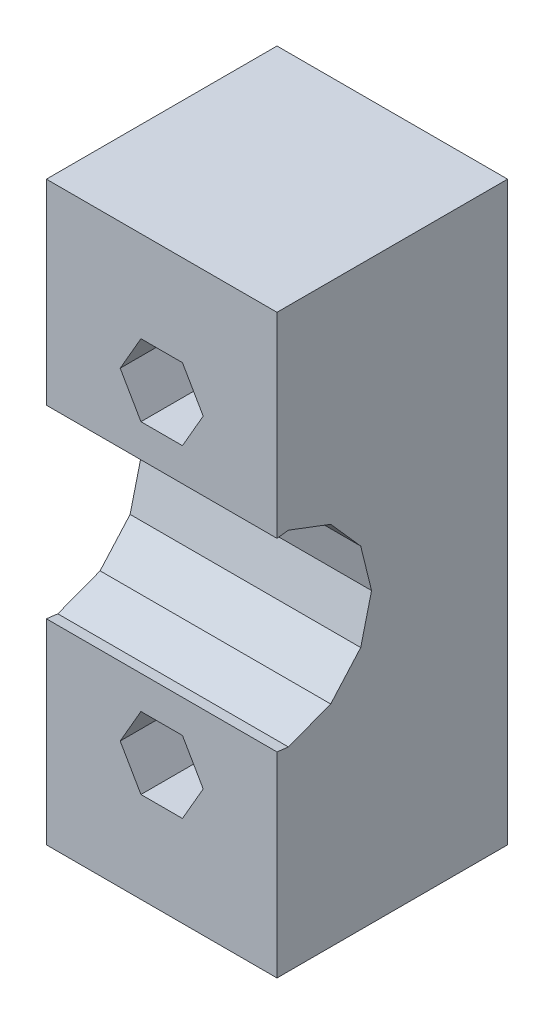
ISO-10303-21;
HEADER;
FILE_DESCRIPTION(('STEP AP214'),'2;1');
FILE_NAME('part.step','',(''),(''),'','','');
FILE_SCHEMA(('AUTOMOTIVE_DESIGN { 1 0 10303 214 1 1 1 1 }'));
ENDSEC;
DATA;
#1=APPLICATION_CONTEXT('core data for automotive mechanical design processes');
#2=APPLICATION_PROTOCOL_DEFINITION('international standard','automotive_design',2000,#1);
#3=PRODUCT_CONTEXT('',#1,'mechanical');
#4=PRODUCT('Part','Part','',(#3));
#5=PRODUCT_RELATED_PRODUCT_CATEGORY('part','',(#4));
#6=PRODUCT_DEFINITION_FORMATION('','',#4);
#7=PRODUCT_DEFINITION_CONTEXT('part definition',#1,'design');
#8=PRODUCT_DEFINITION('design','',#6,#7);
#9=PRODUCT_DEFINITION_SHAPE('','',#8);
#10=(LENGTH_UNIT() NAMED_UNIT(*) SI_UNIT(.MILLI.,.METRE.));
#11=(NAMED_UNIT(*) PLANE_ANGLE_UNIT() SI_UNIT($,.RADIAN.));
#12=(NAMED_UNIT(*) SI_UNIT($,.STERADIAN.) SOLID_ANGLE_UNIT());
#13=UNCERTAINTY_MEASURE_WITH_UNIT(LENGTH_MEASURE(1.E-05),#10,'distance_accuracy_value','');
#14=(GEOMETRIC_REPRESENTATION_CONTEXT(3) GLOBAL_UNCERTAINTY_ASSIGNED_CONTEXT((#13)) GLOBAL_UNIT_ASSIGNED_CONTEXT((#10,
#11,#12)) REPRESENTATION_CONTEXT('',''));
#15=CARTESIAN_POINT('',(0.,0.,0.));
#16=DIRECTION('',(0.,0.,1.));
#17=DIRECTION('',(1.,0.,0.));
#18=AXIS2_PLACEMENT_3D('',#15,#16,#17);
#19=CARTESIAN_POINT('',(0.121361373031,-4.054731070448,9.632423622737));
#20=DIRECTION('',(0.,0.99270878246258,-0.120537434938949));
#21=DIRECTION('',(0.,0.120537434938949,0.99270878246258));
#22=AXIS2_PLACEMENT_3D('',#19,#20,#21);
#23=PLANE('',#22);
#24=DIRECTION('',(1.,0.,0.));
#25=VECTOR('',#24,1.);
#26=CARTESIAN_POINT('',(-0.442914699107,-4.07010602950984,9.50580024719206));
#27=LINE('',#26,#25);
#28=CARTESIAN_POINT('',(-4.99999999999985,-4.07010602951022,9.50580024719204));
#29=VERTEX_POINT('',#28);
#30=CARTESIAN_POINT('',(5.,-4.07010602951012,9.50580024719204));
#31=VERTEX_POINT('',#30);
#32=EDGE_CURVE('E200',#29,#31,#27,.T.);
#33=ORIENTED_EDGE('',*,*,#32,.F.);
#34=DIRECTION('',(0.,-0.120537434938949,-0.99270878246258));
#35=VECTOR('',#34,1.);
#36=CARTESIAN_POINT('',(-5.,-4.025473893236,9.873376624455));
#37=LINE('',#36,#35);
#38=CARTESIAN_POINT('',(-4.99999999999999,-4.01009893417385,9.99999999999998));
#39=VERTEX_POINT('',#38);
#40=EDGE_CURVE('E19',#39,#29,#37,.T.);
#41=ORIENTED_EDGE('',*,*,#40,.F.);
#42=DIRECTION('',(-1.,0.,0.));
#43=VECTOR('',#42,1.);
#44=CARTESIAN_POINT('',(5.,-4.010098934174,10.));
#45=LINE('',#44,#43);
#46=CARTESIAN_POINT('',(5.00000000000001,-4.01009893417388,9.99999999999998));
#47=VERTEX_POINT('',#46);
#48=EDGE_CURVE('E210',#39,#47,#45,.F.);
#49=ORIENTED_EDGE('',*,*,#48,.T.);
#50=DIRECTION('',(0.,-0.120537434937309,-0.992708782462779));
#51=VECTOR('',#50,1.);
#52=CARTESIAN_POINT('',(5.,-4.010098934174,10.));
#53=LINE('',#52,#51);
#54=EDGE_CURVE('E192',#47,#31,#53,.T.);
#55=ORIENTED_EDGE('',*,*,#54,.T.);
#56=EDGE_LOOP('',(#33,#41,#49,#55));
#57=FACE_BOUND('',#56,.T.);
#58=ADVANCED_FACE('F16',(#57),#23,.T.);
#59=CARTESIAN_POINT('',(0.899999976158,5.441154003143,10.));
#60=DIRECTION('',(0.,-1.,0.));
#61=DIRECTION('',(0.,0.,-1.));
#62=AXIS2_PLACEMENT_3D('',#59,#60,#61);
#63=PLANE('',#62);
#64=DIRECTION('',(0.,0.,1.));
#65=VECTOR('',#64,1.);
#66=CARTESIAN_POINT('',(-0.899999976158,5.441154003143,10.));
#67=LINE('',#66,#65);
#68=CARTESIAN_POINT('',(-0.899999976162008,5.44115400314991,0.));
#69=VERTEX_POINT('',#68);
#70=CARTESIAN_POINT('',(-0.899999976155778,5.44115400313916,10.));
#71=VERTEX_POINT('',#70);
#72=EDGE_CURVE('E227',#69,#71,#67,.T.);
#73=ORIENTED_EDGE('',*,*,#72,.T.);
#74=DIRECTION('',(-1.,0.,0.));
#75=VECTOR('',#74,1.);
#76=CARTESIAN_POINT('',(-0.899999976158,5.441154003143,10.));
#77=LINE('',#76,#75);
#78=CARTESIAN_POINT('',(0.899999976158001,5.441154003143,10.));
#79=VERTEX_POINT('',#78);
#80=EDGE_CURVE('E236',#71,#79,#77,.F.);
#81=ORIENTED_EDGE('',*,*,#80,.T.);
#82=DIRECTION('',(0.,0.,1.));
#83=VECTOR('',#82,1.);
#84=CARTESIAN_POINT('',(0.899999976158008,5.44115400314299,10.));
#85=LINE('',#84,#83);
#86=CARTESIAN_POINT('',(0.899999976158011,5.44115400314299,0.));
#87=VERTEX_POINT('',#86);
#88=EDGE_CURVE('E224',#79,#87,#85,.F.);
#89=ORIENTED_EDGE('',*,*,#88,.T.);
#90=DIRECTION('',(1.,0.,0.));
#91=VECTOR('',#90,1.);
#92=CARTESIAN_POINT('',(0.899999976158,5.441154003143,0.));
#93=LINE('',#92,#91);
#94=EDGE_CURVE('E212',#69,#87,#93,.T.);
#95=ORIENTED_EDGE('',*,*,#94,.F.);
#96=EDGE_LOOP('',(#73,#81,#89,#95));
#97=FACE_BOUND('',#96,.T.);
#98=ADVANCED_FACE('F439',(#97),#63,.F.);
#99=CARTESIAN_POINT('',(1.145088556227,-8.134340386022,5.40982297143));
#100=DIRECTION('',(0.866025513253365,-0.49999981039421,0.));
#101=DIRECTION('',(0.49999981039421,0.866025513253365,0.));
#102=AXIS2_PLACEMENT_3D('',#99,#100,#101);
#103=PLANE('',#102);
#104=DIRECTION('',(0.,0.,-1.));
#105=VECTOR('',#104,1.);
#106=CARTESIAN_POINT('',(0.899999976158,-8.558846473694,0.));
#107=LINE('',#106,#105);
#108=CARTESIAN_POINT('',(0.89999997615768,-8.55884647369382,0.));
#109=VERTEX_POINT('',#108);
#110=CARTESIAN_POINT('',(0.89999997615796,-8.55884647369397,10.));
#111=VERTEX_POINT('',#110);
#112=EDGE_CURVE('E250',#109,#111,#107,.F.);
#113=ORIENTED_EDGE('',*,*,#112,.T.);
#114=DIRECTION('',(0.49999981039421,0.866025513253365,0.));
#115=VECTOR('',#114,1.);
#116=CARTESIAN_POINT('',(1.145088556227,-8.134340386022,10.));
#117=LINE('',#116,#115);
#118=CARTESIAN_POINT('',(1.79999995231601,-7.00000000000001,10.));
#119=VERTEX_POINT('',#118);
#120=EDGE_CURVE('E181',#119,#111,#117,.F.);
#121=ORIENTED_EDGE('',*,*,#120,.F.);
#122=DIRECTION('',(0.,0.,1.));
#123=VECTOR('',#122,1.);
#124=CARTESIAN_POINT('',(1.79999995231599,-7.00000000000001,10.));
#125=LINE('',#124,#123);
#126=CARTESIAN_POINT('',(1.79999995231593,-6.99999999999999,0.));
#127=VERTEX_POINT('',#126);
#128=EDGE_CURVE('E222',#119,#127,#125,.F.);
#129=ORIENTED_EDGE('',*,*,#128,.T.);
#130=DIRECTION('',(-0.499999810394001,-0.866025513253486,0.));
#131=VECTOR('',#130,1.);
#132=CARTESIAN_POINT('',(1.799999952316,-7.,0.));
#133=LINE('',#132,#131);
#134=EDGE_CURVE('E247',#127,#109,#133,.T.);
#135=ORIENTED_EDGE('',*,*,#134,.T.);
#136=EDGE_LOOP('',(#113,#121,#129,#135));
#137=FACE_BOUND('',#136,.T.);
#138=ADVANCED_FACE('F614',(#137),#103,.F.);
#139=CARTESIAN_POINT('',(1.554911376783,6.575494050037,4.590177113519));
#140=DIRECTION('',(-0.866025447026178,0.499999925103103,0.));
#141=DIRECTION('',(-0.499999925103103,-0.866025447026178,0.));
#142=AXIS2_PLACEMENT_3D('',#139,#140,#141);
#143=PLANE('',#142);
#144=DIRECTION('',(-0.499999925103108,-0.866025447026175,0.));
#145=VECTOR('',#144,1.);
#146=CARTESIAN_POINT('',(1.799999952316,7.,0.));
#147=LINE('',#146,#145);
#148=CARTESIAN_POINT('',(1.79999995231476,6.99999999999753,0.));
#149=VERTEX_POINT('',#148);
#150=EDGE_CURVE('E255',#149,#87,#147,.T.);
#151=ORIENTED_EDGE('',*,*,#150,.T.);
#152=ORIENTED_EDGE('',*,*,#88,.F.);
#153=DIRECTION('',(0.499999925103108,0.866025447026175,0.));
#154=VECTOR('',#153,1.);
#155=CARTESIAN_POINT('',(0.899999976158,5.441154003143,10.));
#156=LINE('',#155,#154);
#157=CARTESIAN_POINT('',(1.79999995231607,6.99999999999995,10.));
#158=VERTEX_POINT('',#157);
#159=EDGE_CURVE('E258',#79,#158,#156,.T.);
#160=ORIENTED_EDGE('',*,*,#159,.T.);
#161=DIRECTION('',(0.,0.,1.));
#162=VECTOR('',#161,1.);
#163=CARTESIAN_POINT('',(1.79999995231591,6.99999999999995,5.40982297143));
#164=LINE('',#163,#162);
#165=EDGE_CURVE('E261',#158,#149,#164,.F.);
#166=ORIENTED_EDGE('',*,*,#165,.T.);
#167=EDGE_LOOP('',(#151,#152,#160,#166));
#168=FACE_BOUND('',#167,.T.);
#169=ADVANCED_FACE('F454',(#168),#143,.T.);
#170=CARTESIAN_POINT('',(-1.554911376783,6.575494050037,4.590177113519));
#171=DIRECTION('',(0.866025447026178,0.499999925103103,0.));
#172=DIRECTION('',(-0.499999925103103,0.866025447026178,0.));
#173=AXIS2_PLACEMENT_3D('',#170,#171,#172);
#174=PLANE('',#173);
#175=DIRECTION('',(0.,0.,1.));
#176=VECTOR('',#175,1.);
#177=CARTESIAN_POINT('',(-1.79999995231591,6.99999999999995,5.40982297143));
#178=LINE('',#177,#176);
#179=CARTESIAN_POINT('',(-1.79999995231334,6.99999999999525,9.99999999999999));
#180=VERTEX_POINT('',#179);
#181=CARTESIAN_POINT('',(-1.7999999523354,7.00000000003331,0.));
#182=VERTEX_POINT('',#181);
#183=EDGE_CURVE('E267',#180,#182,#178,.F.);
#184=ORIENTED_EDGE('',*,*,#183,.F.);
#185=DIRECTION('',(0.499999925103107,-0.866025447026175,0.));
#186=VECTOR('',#185,1.);
#187=CARTESIAN_POINT('',(-1.799999952316,7.,10.));
#188=LINE('',#187,#186);
#189=EDGE_CURVE('E264',#180,#71,#188,.T.);
#190=ORIENTED_EDGE('',*,*,#189,.T.);
#191=ORIENTED_EDGE('',*,*,#72,.F.);
#192=DIRECTION('',(-0.499999925103103,0.866025447026178,0.));
#193=VECTOR('',#192,1.);
#194=CARTESIAN_POINT('',(-1.554911376783,6.575494050037,0.));
#195=LINE('',#194,#193);
#196=EDGE_CURVE('E207',#69,#182,#195,.T.);
#197=ORIENTED_EDGE('',*,*,#196,.T.);
#198=EDGE_LOOP('',(#184,#190,#191,#197));
#199=FACE_BOUND('',#198,.T.);
#200=ADVANCED_FACE('F444',(#199),#174,.T.);
#201=CARTESIAN_POINT('',(5.,-3.374233961105,7.670935153961));
#202=DIRECTION('',(0.,-0.935016322615487,-0.354604676284185));
#203=DIRECTION('',(0.,0.354604676284185,-0.935016322615487));
#204=AXIS2_PLACEMENT_3D('',#201,#202,#203);
#205=PLANE('',#204);
#206=DIRECTION('',(1.,0.,0.));
#207=VECTOR('',#206,1.);
#208=CARTESIAN_POINT('',(-0.442914888167,-3.37423396110522,7.67093515396075));
#209=LINE('',#208,#207);
#210=CARTESIAN_POINT('',(-5.,-3.37423396110519,7.67093515396092));
#211=VERTEX_POINT('',#210);
#212=CARTESIAN_POINT('',(5.,-3.37423396110503,7.67093515396097));
#213=VERTEX_POINT('',#212);
#214=EDGE_CURVE('E276',#211,#213,#209,.T.);
#215=ORIENTED_EDGE('',*,*,#214,.F.);
#216=DIRECTION('',(0.,-0.354604676284445,0.935016322615389));
#217=VECTOR('',#216,1.);
#218=CARTESIAN_POINT('',(-5.,-3.374233961105,7.670935153961));
#219=LINE('',#218,#217);
#220=EDGE_CURVE('E205',#211,#29,#219,.T.);
#221=ORIENTED_EDGE('',*,*,#220,.T.);
#222=ORIENTED_EDGE('',*,*,#32,.T.);
#223=DIRECTION('',(0.,0.354604676284185,-0.935016322615487));
#224=VECTOR('',#223,1.);
#225=CARTESIAN_POINT('',(5.,-3.374233961105,7.670935153961));
#226=LINE('',#225,#224);
#227=EDGE_CURVE('E186',#213,#31,#226,.F.);
#228=ORIENTED_EDGE('',*,*,#227,.F.);
#229=EDGE_LOOP('',(#215,#221,#222,#228));
#230=FACE_BOUND('',#229,.T.);
#231=ADVANCED_FACE('F204',(#230),#205,.F.);
#232=CARTESIAN_POINT('',(0.899999976158,-8.558846473694,10.));
#233=DIRECTION('',(0.,-1.,0.));
#234=DIRECTION('',(0.,0.,-1.));
#235=AXIS2_PLACEMENT_3D('',#232,#233,#234);
#236=PLANE('',#235);
#237=DIRECTION('',(0.,0.,1.));
#238=VECTOR('',#237,1.);
#239=CARTESIAN_POINT('',(-0.899999976157658,-8.5588464736938,5.40982297143));
#240=LINE('',#239,#238);
#241=CARTESIAN_POINT('',(-0.899999976157972,-8.55884647369398,0.));
#242=VERTEX_POINT('',#241);
#243=CARTESIAN_POINT('',(-0.89999997615799,-8.558846473694,10.));
#244=VERTEX_POINT('',#243);
#245=EDGE_CURVE('E290',#242,#244,#240,.T.);
#246=ORIENTED_EDGE('',*,*,#245,.T.);
#247=DIRECTION('',(1.,0.,0.));
#248=VECTOR('',#247,1.);
#249=CARTESIAN_POINT('',(0.899999976158,-8.558846473694,10.));
#250=LINE('',#249,#248);
#251=EDGE_CURVE('E252',#111,#244,#250,.F.);
#252=ORIENTED_EDGE('',*,*,#251,.F.);
#253=ORIENTED_EDGE('',*,*,#112,.F.);
#254=DIRECTION('',(1.,0.,0.));
#255=VECTOR('',#254,1.);
#256=CARTESIAN_POINT('',(-0.899999976158,-8.558846473694,0.));
#257=LINE('',#256,#255);
#258=EDGE_CURVE('E284',#109,#242,#257,.F.);
#259=ORIENTED_EDGE('',*,*,#258,.T.);
#260=EDGE_LOOP('',(#246,#252,#253,#259));
#261=FACE_BOUND('',#260,.T.);
#262=ADVANCED_FACE('F588',(#261),#236,.F.);
#263=CARTESIAN_POINT('',(-1.799999952316,-7.,10.));
#264=DIRECTION('',(0.,0.,-1.));
#265=DIRECTION('',(-1.,0.,0.));
#266=AXIS2_PLACEMENT_3D('',#263,#264,#265);
#267=PLANE('',#266);
#268=DIRECTION('',(0.,1.,0.));
#269=VECTOR('',#268,1.);
#270=CARTESIAN_POINT('',(5.,-4.010098934174,10.));
#271=LINE('',#270,#269);
#272=CARTESIAN_POINT('',(5.,-12.5,10.));
#273=VERTEX_POINT('',#272);
#274=EDGE_CURVE('E245',#273,#47,#271,.T.);
#275=ORIENTED_EDGE('',*,*,#274,.T.);
#276=ORIENTED_EDGE('',*,*,#48,.F.);
#277=DIRECTION('',(0.,1.,0.));
#278=VECTOR('',#277,1.);
#279=CARTESIAN_POINT('',(-5.,-4.010098934174,10.));
#280=LINE('',#279,#278);
#281=CARTESIAN_POINT('',(-5.,-12.5,10.));
#282=VERTEX_POINT('',#281);
#283=EDGE_CURVE('E214',#282,#39,#280,.T.);
#284=ORIENTED_EDGE('',*,*,#283,.F.);
#285=DIRECTION('',(1.,0.,0.));
#286=VECTOR('',#285,1.);
#287=CARTESIAN_POINT('',(5.,-12.5,10.));
#288=LINE('',#287,#286);
#289=EDGE_CURVE('E242',#282,#273,#288,.T.);
#290=ORIENTED_EDGE('',*,*,#289,.T.);
#291=EDGE_LOOP('',(#275,#276,#284,#290));
#292=FACE_BOUND('',#291,.T.);
#293=DIRECTION('',(-0.499999925103103,-0.866025447026178,0.));
#294=VECTOR('',#293,1.);
#295=CARTESIAN_POINT('',(-1.554911376783,-6.575494050037,10.));
#296=LINE('',#295,#294);
#297=CARTESIAN_POINT('',(-1.79999995231604,-6.99999999999997,10.));
#298=VERTEX_POINT('',#297);
#299=CARTESIAN_POINT('',(-0.899999976157991,-5.441154003143,10.));
#300=VERTEX_POINT('',#299);
#301=EDGE_CURVE('E296',#298,#300,#296,.F.);
#302=ORIENTED_EDGE('',*,*,#301,.T.);
#303=DIRECTION('',(1.,0.,0.));
#304=VECTOR('',#303,1.);
#305=CARTESIAN_POINT('',(-0.899999976158,-5.441154003143,10.));
#306=LINE('',#305,#304);
#307=CARTESIAN_POINT('',(0.899999976157991,-5.44115400314301,10.));
#308=VERTEX_POINT('',#307);
#309=EDGE_CURVE('E293',#300,#308,#306,.T.);
#310=ORIENTED_EDGE('',*,*,#309,.T.);
#311=DIRECTION('',(-0.499999925103103,0.866025447026178,0.));
#312=VECTOR('',#311,1.);
#313=CARTESIAN_POINT('',(0.899999976158,-5.441154003143,10.));
#314=LINE('',#313,#312);
#315=EDGE_CURVE('E220',#308,#119,#314,.F.);
#316=ORIENTED_EDGE('',*,*,#315,.T.);
#317=ORIENTED_EDGE('',*,*,#120,.T.);
#318=ORIENTED_EDGE('',*,*,#251,.T.);
#319=DIRECTION('',(0.49999981039421,-0.866025513253365,0.));
#320=VECTOR('',#319,1.);
#321=CARTESIAN_POINT('',(-1.145088556227,-8.134340386022,10.));
#322=LINE('',#321,#320);
#323=EDGE_CURVE('E287',#244,#298,#322,.F.);
#324=ORIENTED_EDGE('',*,*,#323,.T.);
#325=EDGE_LOOP('',(#302,#310,#316,#317,#318,#324));
#326=FACE_BOUND('',#325,.T.);
#327=ADVANCED_FACE('F407',(#292,#326),#267,.F.);
#328=CARTESIAN_POINT('',(1.145088551691,-5.865659953106,4.590177113519));
#329=DIRECTION('',(0.866025447026178,0.499999925103103,0.));
#330=DIRECTION('',(-0.499999925103103,0.866025447026178,0.));
#331=AXIS2_PLACEMENT_3D('',#328,#329,#330);
#332=PLANE('',#331);
#333=DIRECTION('',(0.499999925103108,-0.866025447026175,0.));
#334=VECTOR('',#333,1.);
#335=CARTESIAN_POINT('',(0.899999976158,-5.441154003143,0.));
#336=LINE('',#335,#334);
#337=CARTESIAN_POINT('',(0.899999976157846,-5.44115400314308,0.));
#338=VERTEX_POINT('',#337);
#339=EDGE_CURVE('E302',#338,#127,#336,.T.);
#340=ORIENTED_EDGE('',*,*,#339,.T.);
#341=ORIENTED_EDGE('',*,*,#128,.F.);
#342=ORIENTED_EDGE('',*,*,#315,.F.);
#343=DIRECTION('',(0.,0.,1.));
#344=VECTOR('',#343,1.);
#345=CARTESIAN_POINT('',(0.899999976158,-5.441154003143,0.));
#346=LINE('',#345,#344);
#347=EDGE_CURVE('E299',#308,#338,#346,.F.);
#348=ORIENTED_EDGE('',*,*,#347,.T.);
#349=EDGE_LOOP('',(#340,#341,#342,#348));
#350=FACE_BOUND('',#349,.T.);
#351=ADVANCED_FACE('F574',(#350),#332,.F.);
#352=CARTESIAN_POINT('',(1.554911372247,7.424506087671,5.40982297143));
#353=DIRECTION('',(0.866025513253365,0.49999981039421,0.));
#354=DIRECTION('',(-0.49999981039421,0.866025513253365,0.));
#355=AXIS2_PLACEMENT_3D('',#352,#353,#354);
#356=PLANE('',#355);
#357=ORIENTED_EDGE('',*,*,#165,.F.);
#358=DIRECTION('',(-0.499999810394001,0.866025513253486,0.));
#359=VECTOR('',#358,1.);
#360=CARTESIAN_POINT('',(1.799999952316,7.,10.));
#361=LINE('',#360,#359);
#362=CARTESIAN_POINT('',(0.899999976157712,8.55884647369383,10.));
#363=VERTEX_POINT('',#362);
#364=EDGE_CURVE('E314',#158,#363,#361,.T.);
#365=ORIENTED_EDGE('',*,*,#364,.T.);
#366=DIRECTION('',(0.,0.,1.));
#367=VECTOR('',#366,1.);
#368=CARTESIAN_POINT('',(0.899999976158,8.558846473694,0.));
#369=LINE('',#368,#367);
#370=CARTESIAN_POINT('',(0.899999976157829,8.5588464736939,0.));
#371=VERTEX_POINT('',#370);
#372=EDGE_CURVE('E270',#363,#371,#369,.F.);
#373=ORIENTED_EDGE('',*,*,#372,.T.);
#374=DIRECTION('',(0.499999810394001,-0.866025513253486,0.));
#375=VECTOR('',#374,1.);
#376=CARTESIAN_POINT('',(0.899999976158,8.558846473694,0.));
#377=LINE('',#376,#375);
#378=EDGE_CURVE('E305',#371,#149,#377,.T.);
#379=ORIENTED_EDGE('',*,*,#378,.T.);
#380=EDGE_LOOP('',(#357,#365,#373,#379));
#381=FACE_BOUND('',#380,.T.);
#382=ADVANCED_FACE('F453',(#381),#356,.F.);
#383=CARTESIAN_POINT('',(-1.145088556227,8.134340386022,4.59017702857));
#384=DIRECTION('',(0.866025513253365,-0.49999981039421,0.));
#385=DIRECTION('',(0.49999981039421,0.866025513253365,0.));
#386=AXIS2_PLACEMENT_3D('',#383,#384,#385);
#387=PLANE('',#386);
#388=DIRECTION('',(0.,0.,1.));
#389=VECTOR('',#388,1.);
#390=CARTESIAN_POINT('',(-0.899999976158,8.558846473694,10.));
#391=LINE('',#390,#389);
#392=CARTESIAN_POINT('',(-0.899999976157957,8.55884647369398,0.));
#393=VERTEX_POINT('',#392);
#394=CARTESIAN_POINT('',(-0.89999997615768,8.55884647369382,10.));
#395=VERTEX_POINT('',#394);
#396=EDGE_CURVE('E320',#393,#395,#391,.T.);
#397=ORIENTED_EDGE('',*,*,#396,.T.);
#398=DIRECTION('',(-0.499999810394001,-0.866025513253486,0.));
#399=VECTOR('',#398,1.);
#400=CARTESIAN_POINT('',(-0.899999976158,8.558846473694,10.));
#401=LINE('',#400,#399);
#402=EDGE_CURVE('E317',#395,#180,#401,.T.);
#403=ORIENTED_EDGE('',*,*,#402,.T.);
#404=ORIENTED_EDGE('',*,*,#183,.T.);
#405=DIRECTION('',(0.49999981039421,0.866025513253365,0.));
#406=VECTOR('',#405,1.);
#407=CARTESIAN_POINT('',(-1.145088556227,8.134340386022,0.));
#408=LINE('',#407,#406);
#409=EDGE_CURVE('E273',#182,#393,#408,.T.);
#410=ORIENTED_EDGE('',*,*,#409,.T.);
#411=EDGE_LOOP('',(#397,#403,#404,#410));
#412=FACE_BOUND('',#411,.T.);
#413=ADVANCED_FACE('F447',(#412),#387,.T.);
#414=CARTESIAN_POINT('',(5.,-3.374233961105,7.670935153961));
#415=DIRECTION('',(0.,-0.663122926257748,-0.748510510728715));
#416=DIRECTION('',(0.,0.748510510728715,-0.663122926257748));
#417=AXIS2_PLACEMENT_3D('',#414,#415,#416);
#418=PLANE('',#417);
#419=DIRECTION('',(1.,0.,0.));
#420=VECTOR('',#419,1.);
#421=CARTESIAN_POINT('',(-0.442914699921,-1.90536499023402,6.36962985992391));
#422=LINE('',#421,#420);
#423=CARTESIAN_POINT('',(5.,-1.90536499023398,6.36962985992404));
#424=VERTEX_POINT('',#423);
#425=CARTESIAN_POINT('',(-5.,-1.9053649902339,6.36962985992411));
#426=VERTEX_POINT('',#425);
#427=EDGE_CURVE('E326',#424,#426,#422,.F.);
#428=ORIENTED_EDGE('',*,*,#427,.T.);
#429=DIRECTION('',(0.,-0.748510510728569,0.663122926257912));
#430=VECTOR('',#429,1.);
#431=CARTESIAN_POINT('',(-5.,-1.905364990234,6.369629859924));
#432=LINE('',#431,#430);
#433=EDGE_CURVE('E323',#426,#211,#432,.T.);
#434=ORIENTED_EDGE('',*,*,#433,.T.);
#435=ORIENTED_EDGE('',*,*,#214,.T.);
#436=DIRECTION('',(0.,0.748510510728715,-0.663122926257748));
#437=VECTOR('',#436,1.);
#438=CARTESIAN_POINT('',(5.,-3.374233961105,7.670935153961));
#439=LINE('',#438,#437);
#440=EDGE_CURVE('E195',#424,#213,#439,.F.);
#441=ORIENTED_EDGE('',*,*,#440,.F.);
#442=EDGE_LOOP('',(#428,#434,#435,#441));
#443=FACE_BOUND('',#442,.T.);
#444=ADVANCED_FACE('F410',(#443),#418,.F.);
#445=CARTESIAN_POINT('',(0.121361373031,4.054731070448,9.632423622737));
#446=DIRECTION('',(0.,-0.99270878246258,-0.120537434938949));
#447=DIRECTION('',(0.,0.120537434938949,-0.99270878246258));
#448=AXIS2_PLACEMENT_3D('',#445,#446,#447);
#449=PLANE('',#448);
#450=DIRECTION('',(0.,-0.120537434937309,0.992708782462779));
#451=VECTOR('',#450,1.);
#452=CARTESIAN_POINT('',(5.,4.07010602951,9.505800247192));
#453=LINE('',#452,#451);
#454=CARTESIAN_POINT('',(5.,4.07010602951005,9.50580024719202));
#455=VERTEX_POINT('',#454);
#456=CARTESIAN_POINT('',(4.99999999999985,4.01009893417382,9.99999999999997));
#457=VERTEX_POINT('',#456);
#458=EDGE_CURVE('E311',#455,#457,#453,.T.);
#459=ORIENTED_EDGE('',*,*,#458,.T.);
#460=DIRECTION('',(1.,0.,0.));
#461=VECTOR('',#460,1.);
#462=CARTESIAN_POINT('',(-0.121361373031,4.01009893417335,9.99999999999992));
#463=LINE('',#462,#461);
#464=CARTESIAN_POINT('',(-5.,4.01009893417367,9.99999999999996));
#465=VERTEX_POINT('',#464);
#466=EDGE_CURVE('E232',#465,#457,#463,.T.);
#467=ORIENTED_EDGE('',*,*,#466,.F.);
#468=DIRECTION('',(0.,-0.120537434938949,0.99270878246258));
#469=VECTOR('',#468,1.);
#470=CARTESIAN_POINT('',(-5.,4.025473893236,9.873376624455));
#471=LINE('',#470,#469);
#472=CARTESIAN_POINT('',(-5.00000000000002,4.07010602951023,9.50580024719204));
#473=VERTEX_POINT('',#472);
#474=EDGE_CURVE('E234',#473,#465,#471,.T.);
#475=ORIENTED_EDGE('',*,*,#474,.F.);
#476=DIRECTION('',(1.,0.,0.));
#477=VECTOR('',#476,1.);
#478=CARTESIAN_POINT('',(-0.442914699107,4.07010602950984,9.50580024719206));
#479=LINE('',#478,#477);
#480=EDGE_CURVE('E340',#473,#455,#479,.T.);
#481=ORIENTED_EDGE('',*,*,#480,.T.);
#482=EDGE_LOOP('',(#459,#467,#475,#481));
#483=FACE_BOUND('',#482,.T.);
#484=ADVANCED_FACE('F428',(#483),#449,.T.);
#485=CARTESIAN_POINT('',(5.,-12.5,0.));
#486=DIRECTION('',(0.,1.,0.));
#487=DIRECTION('',(0.,0.,1.));
#488=AXIS2_PLACEMENT_3D('',#485,#486,#487);
#489=PLANE('',#488);
#490=DIRECTION('',(0.,0.,1.));
#491=VECTOR('',#490,1.);
#492=CARTESIAN_POINT('',(5.,-12.5,0.));
#493=LINE('',#492,#491);
#494=CARTESIAN_POINT('',(4.99999999999992,-12.4999999999995,2.88943197348056E-13));
#495=VERTEX_POINT('',#494);
#496=EDGE_CURVE('E281',#273,#495,#493,.F.);
#497=ORIENTED_EDGE('',*,*,#496,.F.);
#498=ORIENTED_EDGE('',*,*,#289,.F.);
#499=DIRECTION('',(0.,0.,1.));
#500=VECTOR('',#499,1.);
#501=CARTESIAN_POINT('',(-5.,-12.5,10.));
#502=LINE('',#501,#500);
#503=CARTESIAN_POINT('',(-5.,-12.5,0.));
#504=VERTEX_POINT('',#503);
#505=EDGE_CURVE('E239',#504,#282,#502,.T.);
#506=ORIENTED_EDGE('',*,*,#505,.F.);
#507=DIRECTION('',(1.,0.,0.));
#508=VECTOR('',#507,1.);
#509=CARTESIAN_POINT('',(-5.,-12.5,0.));
#510=LINE('',#509,#508);
#511=EDGE_CURVE('E344',#504,#495,#510,.T.);
#512=ORIENTED_EDGE('',*,*,#511,.T.);
#513=EDGE_LOOP('',(#497,#498,#506,#512));
#514=FACE_BOUND('',#513,.T.);
#515=ADVANCED_FACE('F405',(#514),#489,.F.);
#516=CARTESIAN_POINT('',(-0.899999976158,-5.441154003143,0.));
#517=DIRECTION('',(0.,1.,0.));
#518=DIRECTION('',(0.,0.,1.));
#519=AXIS2_PLACEMENT_3D('',#516,#517,#518);
#520=PLANE('',#519);
#521=ORIENTED_EDGE('',*,*,#347,.F.);
#522=ORIENTED_EDGE('',*,*,#309,.F.);
#523=DIRECTION('',(0.,0.,1.));
#524=VECTOR('',#523,1.);
#525=CARTESIAN_POINT('',(-0.8999999761577,-5.44115400314317,4.590177113519));
#526=LINE('',#525,#524);
#527=CARTESIAN_POINT('',(-0.899999976157962,-5.44115400314302,0.));
#528=VERTEX_POINT('',#527);
#529=EDGE_CURVE('E350',#528,#300,#526,.T.);
#530=ORIENTED_EDGE('',*,*,#529,.F.);
#531=DIRECTION('',(1.,0.,0.));
#532=VECTOR('',#531,1.);
#533=CARTESIAN_POINT('',(-0.899999976158,-5.441154003143,0.));
#534=LINE('',#533,#532);
#535=EDGE_CURVE('E353',#528,#338,#534,.T.);
#536=ORIENTED_EDGE('',*,*,#535,.T.);
#537=EDGE_LOOP('',(#521,#522,#530,#536));
#538=FACE_BOUND('',#537,.T.);
#539=ADVANCED_FACE('F536',(#538),#520,.F.);
#540=CARTESIAN_POINT('',(-0.899999976158,8.558846473694,10.));
#541=DIRECTION('',(0.,1.,0.));
#542=DIRECTION('',(0.,0.,1.));
#543=AXIS2_PLACEMENT_3D('',#540,#541,#542);
#544=PLANE('',#543);
#545=ORIENTED_EDGE('',*,*,#396,.F.);
#546=DIRECTION('',(1.,0.,0.));
#547=VECTOR('',#546,1.);
#548=CARTESIAN_POINT('',(-0.899999976158,8.558846473694,0.));
#549=LINE('',#548,#547);
#550=EDGE_CURVE('E308',#393,#371,#549,.T.);
#551=ORIENTED_EDGE('',*,*,#550,.T.);
#552=ORIENTED_EDGE('',*,*,#372,.F.);
#553=DIRECTION('',(-1.,0.,0.));
#554=VECTOR('',#553,1.);
#555=CARTESIAN_POINT('',(-0.899999976158,8.558846473694,10.));
#556=LINE('',#555,#554);
#557=EDGE_CURVE('E358',#363,#395,#556,.T.);
#558=ORIENTED_EDGE('',*,*,#557,.T.);
#559=EDGE_LOOP('',(#545,#551,#552,#558));
#560=FACE_BOUND('',#559,.T.);
#561=ADVANCED_FACE('F451',(#560),#544,.F.);
#562=CARTESIAN_POINT('',(-0.442914699921,-1.382726926437,6.240811291247));
#563=DIRECTION('',(0.,-0.239315411342116,-0.970941879771469));
#564=DIRECTION('',(0.,0.970941879771469,-0.239315411342116));
#565=AXIS2_PLACEMENT_3D('',#562,#563,#564);
#566=PLANE('',#565);
#567=ORIENTED_EDGE('',*,*,#427,.F.);
#568=DIRECTION('',(0.,-0.970941879771469,0.239315411342116));
#569=VECTOR('',#568,1.);
#570=CARTESIAN_POINT('',(5.,-0.522638063797,6.028818664045));
#571=LINE('',#570,#569);
#572=CARTESIAN_POINT('',(5.,0.,5.90000009536725));
#573=VERTEX_POINT('',#572);
#574=EDGE_CURVE('E279',#424,#573,#571,.F.);
#575=ORIENTED_EDGE('',*,*,#574,.T.);
#576=DIRECTION('',(1.,0.,0.));
#577=VECTOR('',#576,1.);
#578=CARTESIAN_POINT('',(0.442914699921,-2.54136989230602E-13,5.90000009536803));
#579=LINE('',#578,#577);
#580=CARTESIAN_POINT('',(-5.00000000000002,1.38665035585192E-13,5.90000009536786));
#581=VERTEX_POINT('',#580);
#582=EDGE_CURVE('E332',#573,#581,#579,.F.);
#583=ORIENTED_EDGE('',*,*,#582,.T.);
#584=DIRECTION('',(0.,-0.970941879771361,0.239315411342556));
#585=VECTOR('',#584,1.);
#586=CARTESIAN_POINT('',(-5.,0.,5.900000095367));
#587=LINE('',#586,#585);
#588=EDGE_CURVE('E361',#581,#426,#587,.T.);
#589=ORIENTED_EDGE('',*,*,#588,.T.);
#590=EDGE_LOOP('',(#567,#575,#583,#589));
#591=FACE_BOUND('',#590,.T.);
#592=ADVANCED_FACE('F413',(#591),#566,.F.);
#593=CARTESIAN_POINT('',(-0.442914699107,3.879229618806,9.002500173768));
#594=DIRECTION('',(0.,0.935016322615487,-0.354604676284185));
#595=DIRECTION('',(0.,0.354604676284185,0.935016322615487));
#596=AXIS2_PLACEMENT_3D('',#593,#594,#595);
#597=PLANE('',#596);
#598=DIRECTION('',(0.,-0.354604676284445,-0.935016322615388));
#599=VECTOR('',#598,1.);
#600=CARTESIAN_POINT('',(-5.,4.07010602951,9.505800247192));
#601=LINE('',#600,#599);
#602=CARTESIAN_POINT('',(-4.99999999999999,3.3742339611052,7.67093515396091));
#603=VERTEX_POINT('',#602);
#604=EDGE_CURVE('E369',#473,#603,#601,.T.);
#605=ORIENTED_EDGE('',*,*,#604,.T.);
#606=DIRECTION('',(1.,0.,0.));
#607=VECTOR('',#606,1.);
#608=CARTESIAN_POINT('',(-0.442914888167,3.37423396110522,7.67093515396075));
#609=LINE('',#608,#607);
#610=CARTESIAN_POINT('',(5.,3.37423396110507,7.67093515396094));
#611=VERTEX_POINT('',#610);
#612=EDGE_CURVE('E366',#603,#611,#609,.T.);
#613=ORIENTED_EDGE('',*,*,#612,.T.);
#614=DIRECTION('',(0.,-0.354604676284185,-0.935016322615487));
#615=VECTOR('',#614,1.);
#616=CARTESIAN_POINT('',(5.,3.565110371809,8.174235227385));
#617=LINE('',#616,#615);
#618=EDGE_CURVE('E335',#611,#455,#617,.F.);
#619=ORIENTED_EDGE('',*,*,#618,.T.);
#620=ORIENTED_EDGE('',*,*,#480,.F.);
#621=EDGE_LOOP('',(#605,#613,#619,#620));
#622=FACE_BOUND('',#621,.T.);
#623=ADVANCED_FACE('F425',(#622),#597,.F.);
#624=CARTESIAN_POINT('',(-1.554911372247,-7.424506087671,4.59017702857));
#625=DIRECTION('',(0.866025513253365,0.49999981039421,0.));
#626=DIRECTION('',(-0.49999981039421,0.866025513253365,0.));
#627=AXIS2_PLACEMENT_3D('',#624,#625,#626);
#628=PLANE('',#627);
#629=DIRECTION('',(0.,0.,1.));
#630=VECTOR('',#629,1.);
#631=CARTESIAN_POINT('',(-1.79999995231591,-6.99999999999995,4.59017702857));
#632=LINE('',#631,#630);
#633=CARTESIAN_POINT('',(-1.79999995231609,-6.99999999999992,0.));
#634=VERTEX_POINT('',#633);
#635=EDGE_CURVE('E347',#634,#298,#632,.T.);
#636=ORIENTED_EDGE('',*,*,#635,.T.);
#637=ORIENTED_EDGE('',*,*,#323,.F.);
#638=ORIENTED_EDGE('',*,*,#245,.F.);
#639=DIRECTION('',(-0.499999810394001,0.866025513253486,0.));
#640=VECTOR('',#639,1.);
#641=CARTESIAN_POINT('',(-0.899999976158,-8.558846473694,0.));
#642=LINE('',#641,#640);
#643=EDGE_CURVE('E372',#242,#634,#642,.T.);
#644=ORIENTED_EDGE('',*,*,#643,.T.);
#645=EDGE_LOOP('',(#636,#637,#638,#644));
#646=FACE_BOUND('',#645,.T.);
#647=ADVANCED_FACE('F509',(#646),#628,.T.);
#648=CARTESIAN_POINT('',(-1.145088551691,-5.865659953106,4.590177113519));
#649=DIRECTION('',(0.866025447026178,-0.499999925103103,0.));
#650=DIRECTION('',(0.499999925103103,0.866025447026178,0.));
#651=AXIS2_PLACEMENT_3D('',#648,#649,#650);
#652=PLANE('',#651);
#653=ORIENTED_EDGE('',*,*,#529,.T.);
#654=ORIENTED_EDGE('',*,*,#301,.F.);
#655=ORIENTED_EDGE('',*,*,#635,.F.);
#656=DIRECTION('',(0.499999925103108,0.866025447026175,0.));
#657=VECTOR('',#656,1.);
#658=CARTESIAN_POINT('',(-1.799999952316,-7.,0.));
#659=LINE('',#658,#657);
#660=EDGE_CURVE('E375',#634,#528,#659,.T.);
#661=ORIENTED_EDGE('',*,*,#660,.T.);
#662=EDGE_LOOP('',(#653,#654,#655,#661));
#663=FACE_BOUND('',#662,.T.);
#664=ADVANCED_FACE('F502',(#663),#652,.T.);
#665=CARTESIAN_POINT('',(5.,12.5,10.));
#666=DIRECTION('',(-1.,0.,0.));
#667=DIRECTION('',(0.,0.,1.));
#668=AXIS2_PLACEMENT_3D('',#665,#666,#667);
#669=PLANE('',#668);
#670=DIRECTION('',(0.,1.,0.));
#671=VECTOR('',#670,1.);
#672=CARTESIAN_POINT('',(5.,12.5,10.));
#673=LINE('',#672,#671);
#674=CARTESIAN_POINT('',(5.,12.5,10.));
#675=VERTEX_POINT('',#674);
#676=EDGE_CURVE('E356',#675,#457,#673,.F.);
#677=ORIENTED_EDGE('',*,*,#676,.T.);
#678=ORIENTED_EDGE('',*,*,#458,.F.);
#679=ORIENTED_EDGE('',*,*,#618,.F.);
#680=DIRECTION('',(0.,-0.748510510728715,-0.663122926257748));
#681=VECTOR('',#680,1.);
#682=CARTESIAN_POINT('',(5.,2.308273026519,6.726575490218));
#683=LINE('',#682,#681);
#684=CARTESIAN_POINT('',(5.,1.905364990234,6.369629859924));
#685=VERTEX_POINT('',#684);
#686=EDGE_CURVE('E338',#685,#611,#683,.F.);
#687=ORIENTED_EDGE('',*,*,#686,.F.);
#688=DIRECTION('',(0.,0.970941879771469,0.239315411342116));
#689=VECTOR('',#688,1.);
#690=CARTESIAN_POINT('',(5.,0.522638063797,6.028818664045));
#691=LINE('',#690,#689);
#692=EDGE_CURVE('E329',#685,#573,#691,.F.);
#693=ORIENTED_EDGE('',*,*,#692,.T.);
#694=ORIENTED_EDGE('',*,*,#574,.F.);
#695=ORIENTED_EDGE('',*,*,#440,.T.);
#696=ORIENTED_EDGE('',*,*,#227,.T.);
#697=ORIENTED_EDGE('',*,*,#54,.F.);
#698=ORIENTED_EDGE('',*,*,#274,.F.);
#699=ORIENTED_EDGE('',*,*,#496,.T.);
#700=DIRECTION('',(0.,1.,0.));
#701=VECTOR('',#700,1.);
#702=CARTESIAN_POINT('',(5.,12.5,0.));
#703=LINE('',#702,#701);
#704=CARTESIAN_POINT('',(5.00000000006951,12.5000000001195,0.));
#705=VERTEX_POINT('',#704);
#706=EDGE_CURVE('E199',#705,#495,#703,.F.);
#707=ORIENTED_EDGE('',*,*,#706,.F.);
#708=DIRECTION('',(0.,0.,-1.));
#709=VECTOR('',#708,1.);
#710=CARTESIAN_POINT('',(5.,12.5,0.));
#711=LINE('',#710,#709);
#712=EDGE_CURVE('E381',#705,#675,#711,.F.);
#713=ORIENTED_EDGE('',*,*,#712,.T.);
#714=EDGE_LOOP('',(#677,#678,#679,#687,#693,#694,#695,#696,#697,#698,#699,#707,#713));
#715=FACE_BOUND('',#714,.T.);
#716=ADVANCED_FACE('F189',(#715),#669,.F.);
#717=CARTESIAN_POINT('',(-0.442914699921,1.382726926437,6.240811291247));
#718=DIRECTION('',(0.,-0.239315411342116,0.970941879771469));
#719=DIRECTION('',(0.,-0.970941879771469,-0.239315411342116));
#720=AXIS2_PLACEMENT_3D('',#717,#718,#719);
#721=PLANE('',#720);
#722=DIRECTION('',(0.,-0.970941879771361,-0.239315411342556));
#723=VECTOR('',#722,1.);
#724=CARTESIAN_POINT('',(-5.,1.905364990234,6.369629859924));
#725=LINE('',#724,#723);
#726=CARTESIAN_POINT('',(-5.,1.90536499023411,6.36962985992387));
#727=VERTEX_POINT('',#726);
#728=EDGE_CURVE('E384',#727,#581,#725,.T.);
#729=ORIENTED_EDGE('',*,*,#728,.T.);
#730=ORIENTED_EDGE('',*,*,#582,.F.);
#731=ORIENTED_EDGE('',*,*,#692,.F.);
#732=DIRECTION('',(1.,0.,0.));
#733=VECTOR('',#732,1.);
#734=CARTESIAN_POINT('',(-0.442914699921,1.90536499023402,6.36962985992391));
#735=LINE('',#734,#733);
#736=EDGE_CURVE('E364',#685,#727,#735,.F.);
#737=ORIENTED_EDGE('',*,*,#736,.T.);
#738=EDGE_LOOP('',(#729,#730,#731,#737));
#739=FACE_BOUND('',#738,.T.);
#740=ADVANCED_FACE('F489',(#739),#721,.T.);
#741=CARTESIAN_POINT('',(-0.442914888167,2.971325924821,7.313989523667));
#742=DIRECTION('',(0.,0.663122926257748,-0.748510510728715));
#743=DIRECTION('',(0.,0.748510510728715,0.663122926257748));
#744=AXIS2_PLACEMENT_3D('',#741,#742,#743);
#745=PLANE('',#744);
#746=DIRECTION('',(0.,-0.748510510728569,-0.663122926257912));
#747=VECTOR('',#746,1.);
#748=CARTESIAN_POINT('',(-5.,3.374233961105,7.670935153961));
#749=LINE('',#748,#747);
#750=EDGE_CURVE('E387',#603,#727,#749,.T.);
#751=ORIENTED_EDGE('',*,*,#750,.T.);
#752=ORIENTED_EDGE('',*,*,#736,.F.);
#753=ORIENTED_EDGE('',*,*,#686,.T.);
#754=ORIENTED_EDGE('',*,*,#612,.F.);
#755=EDGE_LOOP('',(#751,#752,#753,#754));
#756=FACE_BOUND('',#755,.T.);
#757=ADVANCED_FACE('F421',(#756),#745,.F.);
#758=CARTESIAN_POINT('',(5.,12.5,10.));
#759=DIRECTION('',(0.,0.,-1.));
#760=DIRECTION('',(-1.,0.,0.));
#761=AXIS2_PLACEMENT_3D('',#758,#759,#760);
#762=PLANE('',#761);
#763=DIRECTION('',(0.,1.,0.));
#764=VECTOR('',#763,1.);
#765=CARTESIAN_POINT('',(-5.,4.07010602951,10.));
#766=LINE('',#765,#764);
#767=CARTESIAN_POINT('',(-4.99999999919851,12.4999999986213,10.));
#768=VERTEX_POINT('',#767);
#769=EDGE_CURVE('E34',#768,#465,#766,.F.);
#770=ORIENTED_EDGE('',*,*,#769,.T.);
#771=ORIENTED_EDGE('',*,*,#466,.T.);
#772=ORIENTED_EDGE('',*,*,#676,.F.);
#773=DIRECTION('',(1.,0.,0.));
#774=VECTOR('',#773,1.);
#775=CARTESIAN_POINT('',(-5.,12.5,10.));
#776=LINE('',#775,#774);
#777=EDGE_CURVE('E390',#675,#768,#776,.F.);
#778=ORIENTED_EDGE('',*,*,#777,.T.);
#779=EDGE_LOOP('',(#770,#771,#772,#778));
#780=FACE_BOUND('',#779,.T.);
#781=ORIENTED_EDGE('',*,*,#159,.F.);
#782=ORIENTED_EDGE('',*,*,#80,.F.);
#783=ORIENTED_EDGE('',*,*,#189,.F.);
#784=ORIENTED_EDGE('',*,*,#402,.F.);
#785=ORIENTED_EDGE('',*,*,#557,.F.);
#786=ORIENTED_EDGE('',*,*,#364,.F.);
#787=EDGE_LOOP('',(#781,#782,#783,#784,#785,#786));
#788=FACE_BOUND('',#787,.T.);
#789=ADVANCED_FACE('F430',(#780,#788),#762,.F.);
#790=CARTESIAN_POINT('',(-5.,-12.5,0.));
#791=DIRECTION('',(0.,0.,1.));
#792=DIRECTION('',(1.,0.,0.));
#793=AXIS2_PLACEMENT_3D('',#790,#791,#792);
#794=PLANE('',#793);
#795=ORIENTED_EDGE('',*,*,#196,.F.);
#796=ORIENTED_EDGE('',*,*,#94,.T.);
#797=ORIENTED_EDGE('',*,*,#150,.F.);
#798=ORIENTED_EDGE('',*,*,#378,.F.);
#799=ORIENTED_EDGE('',*,*,#550,.F.);
#800=ORIENTED_EDGE('',*,*,#409,.F.);
#801=EDGE_LOOP('',(#795,#796,#797,#798,#799,#800));
#802=FACE_BOUND('',#801,.T.);
#803=ORIENTED_EDGE('',*,*,#706,.T.);
#804=ORIENTED_EDGE('',*,*,#511,.F.);
#805=DIRECTION('',(0.,1.,0.));
#806=VECTOR('',#805,1.);
#807=CARTESIAN_POINT('',(-5.,-12.5,0.));
#808=LINE('',#807,#806);
#809=CARTESIAN_POINT('',(-5.00000000013534,12.5000000002329,0.));
#810=VERTEX_POINT('',#809);
#811=EDGE_CURVE('E25',#504,#810,#808,.T.);
#812=ORIENTED_EDGE('',*,*,#811,.T.);
#813=DIRECTION('',(1.,0.,0.));
#814=VECTOR('',#813,1.);
#815=CARTESIAN_POINT('',(-5.,12.5,0.));
#816=LINE('',#815,#814);
#817=EDGE_CURVE('E378',#810,#705,#816,.T.);
#818=ORIENTED_EDGE('',*,*,#817,.T.);
#819=EDGE_LOOP('',(#803,#804,#812,#818));
#820=FACE_BOUND('',#819,.T.);
#821=ORIENTED_EDGE('',*,*,#134,.F.);
#822=ORIENTED_EDGE('',*,*,#339,.F.);
#823=ORIENTED_EDGE('',*,*,#535,.F.);
#824=ORIENTED_EDGE('',*,*,#660,.F.);
#825=ORIENTED_EDGE('',*,*,#643,.F.);
#826=ORIENTED_EDGE('',*,*,#258,.F.);
#827=EDGE_LOOP('',(#821,#822,#823,#824,#825,#826));
#828=FACE_BOUND('',#827,.T.);
#829=ADVANCED_FACE('F396',(#802,#820,#828),#794,.F.);
#830=CARTESIAN_POINT('',(-5.,12.5,10.));
#831=DIRECTION('',(0.,-1.,0.));
#832=DIRECTION('',(0.,0.,-1.));
#833=AXIS2_PLACEMENT_3D('',#830,#831,#832);
#834=PLANE('',#833);
#835=ORIENTED_EDGE('',*,*,#777,.F.);
#836=ORIENTED_EDGE('',*,*,#712,.F.);
#837=ORIENTED_EDGE('',*,*,#817,.F.);
#838=DIRECTION('',(0.,0.,-1.));
#839=VECTOR('',#838,1.);
#840=CARTESIAN_POINT('',(-5.,12.5,0.));
#841=LINE('',#840,#839);
#842=EDGE_CURVE('E10',#810,#768,#841,.F.);
#843=ORIENTED_EDGE('',*,*,#842,.T.);
#844=EDGE_LOOP('',(#835,#836,#837,#843));
#845=FACE_BOUND('',#844,.T.);
#846=ADVANCED_FACE('F403',(#845),#834,.F.);
#847=CARTESIAN_POINT('',(-5.,-12.5,0.));
#848=DIRECTION('',(1.,0.,0.));
#849=DIRECTION('',(0.,0.,-1.));
#850=AXIS2_PLACEMENT_3D('',#847,#848,#849);
#851=PLANE('',#850);
#852=ORIENTED_EDGE('',*,*,#842,.F.);
#853=ORIENTED_EDGE('',*,*,#811,.F.);
#854=ORIENTED_EDGE('',*,*,#505,.T.);
#855=ORIENTED_EDGE('',*,*,#283,.T.);
#856=ORIENTED_EDGE('',*,*,#40,.T.);
#857=ORIENTED_EDGE('',*,*,#220,.F.);
#858=ORIENTED_EDGE('',*,*,#433,.F.);
#859=ORIENTED_EDGE('',*,*,#588,.F.);
#860=ORIENTED_EDGE('',*,*,#728,.F.);
#861=ORIENTED_EDGE('',*,*,#750,.F.);
#862=ORIENTED_EDGE('',*,*,#604,.F.);
#863=ORIENTED_EDGE('',*,*,#474,.T.);
#864=ORIENTED_EDGE('',*,*,#769,.F.);
#865=EDGE_LOOP('',(#852,#853,#854,#855,#856,#857,#858,#859,#860,#861,#862,#863,#864));
#866=FACE_BOUND('',#865,.T.);
#867=ADVANCED_FACE('F399',(#866),#851,.F.);
#868=CLOSED_SHELL('',(#58,#98,#138,#169,#200,#231,#262,#327,#351,#382,#413,#444,#484,#515,#539,
#561,#592,#623,#647,#664,#716,#740,#757,#789,#829,#846,#867));
#869=MANIFOLD_SOLID_BREP('B1',#868);
#870=ADVANCED_BREP_SHAPE_REPRESENTATION('',(#18,#869),#14);
#871=SHAPE_DEFINITION_REPRESENTATION(#9,#870);
ENDSEC;
END-ISO-10303-21;
